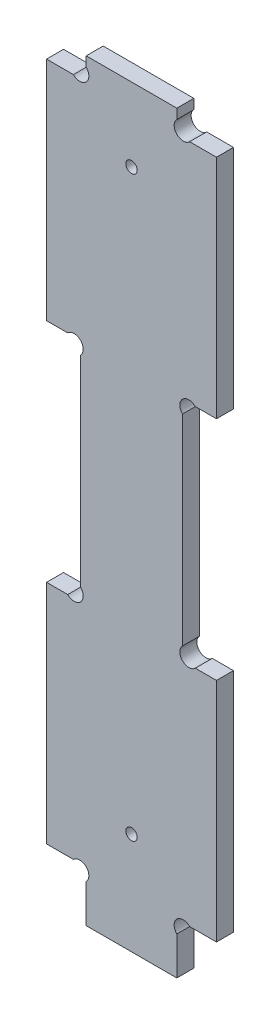
ISO-10303-21;
HEADER;
FILE_DESCRIPTION(('STEP AP214'),'2;1');
FILE_NAME('part.step','',(''),(''),'','','');
FILE_SCHEMA(('AUTOMOTIVE_DESIGN { 1 0 10303 214 1 1 1 1 }'));
ENDSEC;
DATA;
#1=APPLICATION_CONTEXT('core data for automotive mechanical design processes');
#2=APPLICATION_PROTOCOL_DEFINITION('international standard','automotive_design',2000,#1);
#3=PRODUCT_CONTEXT('',#1,'mechanical');
#4=PRODUCT('Part','Part','',(#3));
#5=PRODUCT_RELATED_PRODUCT_CATEGORY('part','',(#4));
#6=PRODUCT_DEFINITION_FORMATION('','',#4);
#7=PRODUCT_DEFINITION_CONTEXT('part definition',#1,'design');
#8=PRODUCT_DEFINITION('design','',#6,#7);
#9=PRODUCT_DEFINITION_SHAPE('','',#8);
#10=(LENGTH_UNIT() NAMED_UNIT(*) SI_UNIT(.MILLI.,.METRE.));
#11=(NAMED_UNIT(*) PLANE_ANGLE_UNIT() SI_UNIT($,.RADIAN.));
#12=(NAMED_UNIT(*) SI_UNIT($,.STERADIAN.) SOLID_ANGLE_UNIT());
#13=UNCERTAINTY_MEASURE_WITH_UNIT(LENGTH_MEASURE(1.E-05),#10,'distance_accuracy_value','');
#14=(GEOMETRIC_REPRESENTATION_CONTEXT(3) GLOBAL_UNCERTAINTY_ASSIGNED_CONTEXT((#13)) GLOBAL_UNIT_ASSIGNED_CONTEXT((#10,
#11,#12)) REPRESENTATION_CONTEXT('',''));
#15=CARTESIAN_POINT('',(0.,0.,0.));
#16=DIRECTION('',(0.,0.,1.));
#17=DIRECTION('',(1.,0.,0.));
#18=AXIS2_PLACEMENT_3D('',#15,#16,#17);
#19=CARTESIAN_POINT('',(30.,49.,3.));
#20=DIRECTION('',(-1.,0.,0.));
#21=DIRECTION('',(0.,-1.,0.));
#22=AXIS2_PLACEMENT_3D('',#19,#20,#21);
#23=PLANE('',#22);
#24=DIRECTION('',(0.,1.,0.));
#25=VECTOR('',#24,1.);
#26=CARTESIAN_POINT('',(30.,49.,0.));
#27=LINE('',#26,#25);
#28=CARTESIAN_POINT('',(30.,9.,0.));
#29=VERTEX_POINT('',#28);
#30=CARTESIAN_POINT('',(30.,49.,0.));
#31=VERTEX_POINT('',#30);
#32=EDGE_CURVE('E250',#29,#31,#27,.T.);
#33=ORIENTED_EDGE('',*,*,#32,.T.);
#34=DIRECTION('',(0.,0.,-1.));
#35=VECTOR('',#34,1.);
#36=CARTESIAN_POINT('',(30.,49.,3.));
#37=LINE('',#36,#35);
#38=CARTESIAN_POINT('',(30.,49.,3.));
#39=VERTEX_POINT('',#38);
#40=EDGE_CURVE('E11',#39,#31,#37,.T.);
#41=ORIENTED_EDGE('',*,*,#40,.F.);
#42=DIRECTION('',(0.,1.,0.));
#43=VECTOR('',#42,1.);
#44=CARTESIAN_POINT('',(30.,49.,3.));
#45=LINE('',#44,#43);
#46=CARTESIAN_POINT('',(30.,9.,3.));
#47=VERTEX_POINT('',#46);
#48=EDGE_CURVE('E305',#47,#39,#45,.T.);
#49=ORIENTED_EDGE('',*,*,#48,.F.);
#50=DIRECTION('',(0.,0.,-1.));
#51=VECTOR('',#50,1.);
#52=CARTESIAN_POINT('',(30.,9.,3.));
#53=LINE('',#52,#51);
#54=EDGE_CURVE('E246',#47,#29,#53,.T.);
#55=ORIENTED_EDGE('',*,*,#54,.T.);
#56=EDGE_LOOP('',(#33,#41,#49,#55));
#57=FACE_BOUND('',#56,.T.);
#58=ADVANCED_FACE('F34',(#57),#23,.F.);
#59=CARTESIAN_POINT('',(26.262741699797,49.,3.));
#60=DIRECTION('',(0.,-1.,0.));
#61=DIRECTION('',(0.,0.,-1.));
#62=AXIS2_PLACEMENT_3D('',#59,#60,#61);
#63=PLANE('',#62);
#64=DIRECTION('',(-1.,0.,0.));
#65=VECTOR('',#64,1.);
#66=CARTESIAN_POINT('',(26.262741699797,49.,0.));
#67=LINE('',#66,#65);
#68=CARTESIAN_POINT('',(26.262741699797,49.,0.));
#69=VERTEX_POINT('',#68);
#70=EDGE_CURVE('E253',#31,#69,#67,.T.);
#71=ORIENTED_EDGE('',*,*,#70,.T.);
#72=DIRECTION('',(0.,0.,-1.));
#73=VECTOR('',#72,1.);
#74=CARTESIAN_POINT('',(26.262741699797,49.,3.));
#75=LINE('',#74,#73);
#76=CARTESIAN_POINT('',(26.262741699797,49.,3.));
#77=VERTEX_POINT('',#76);
#78=EDGE_CURVE('E42',#77,#69,#75,.T.);
#79=ORIENTED_EDGE('',*,*,#78,.F.);
#80=DIRECTION('',(-1.,0.,0.));
#81=VECTOR('',#80,1.);
#82=CARTESIAN_POINT('',(26.262741699797,49.,3.));
#83=LINE('',#82,#81);
#84=EDGE_CURVE('E153',#39,#77,#83,.T.);
#85=ORIENTED_EDGE('',*,*,#84,.F.);
#86=ORIENTED_EDGE('',*,*,#40,.T.);
#87=EDGE_LOOP('',(#71,#79,#85,#86));
#88=FACE_BOUND('',#87,.T.);
#89=ADVANCED_FACE('F464',(#88),#63,.F.);
#90=CARTESIAN_POINT('',(25.1313708498985,50.1313708498985,3.));
#91=DIRECTION('',(0.,0.,-1.));
#92=DIRECTION('',(-1.,0.,0.));
#93=AXIS2_PLACEMENT_3D('',#90,#91,#92);
#94=CYLINDRICAL_SURFACE('',#93,1.60000000000001);
#95=CARTESIAN_POINT('',(25.1313708498985,50.1313708498985,0.));
#96=DIRECTION('',(0.,0.,-1.));
#97=DIRECTION('',(1.,0.,0.));
#98=AXIS2_PLACEMENT_3D('',#95,#96,#97);
#99=CIRCLE('',#98,1.60000000000001);
#100=CARTESIAN_POINT('',(24.,51.262741699797,0.));
#101=VERTEX_POINT('',#100);
#102=EDGE_CURVE('E256',#69,#101,#99,.T.);
#103=ORIENTED_EDGE('',*,*,#102,.T.);
#104=DIRECTION('',(0.,0.,-1.));
#105=VECTOR('',#104,1.);
#106=CARTESIAN_POINT('',(24.,51.262741699797,3.));
#107=LINE('',#106,#105);
#108=CARTESIAN_POINT('',(24.,51.262741699797,3.));
#109=VERTEX_POINT('',#108);
#110=EDGE_CURVE('E372',#109,#101,#107,.T.);
#111=ORIENTED_EDGE('',*,*,#110,.F.);
#112=CARTESIAN_POINT('',(25.1313708498985,50.1313708498985,3.));
#113=DIRECTION('',(0.,0.,-1.));
#114=DIRECTION('',(1.,0.,0.));
#115=AXIS2_PLACEMENT_3D('',#112,#113,#114);
#116=CIRCLE('',#115,1.60000000000001);
#117=EDGE_CURVE('E380',#77,#109,#116,.T.);
#118=ORIENTED_EDGE('',*,*,#117,.F.);
#119=ORIENTED_EDGE('',*,*,#78,.T.);
#120=EDGE_LOOP('',(#103,#111,#118,#119));
#121=FACE_BOUND('',#120,.T.);
#122=ADVANCED_FACE('F378',(#121),#94,.F.);
#123=CARTESIAN_POINT('',(24.,86.737258300203,3.));
#124=DIRECTION('',(-1.,0.,0.));
#125=DIRECTION('',(0.,-1.,0.));
#126=AXIS2_PLACEMENT_3D('',#123,#124,#125);
#127=PLANE('',#126);
#128=DIRECTION('',(0.,1.,0.));
#129=VECTOR('',#128,1.);
#130=CARTESIAN_POINT('',(24.,86.737258300203,0.));
#131=LINE('',#130,#129);
#132=CARTESIAN_POINT('',(24.,86.737258300203,0.));
#133=VERTEX_POINT('',#132);
#134=EDGE_CURVE('E258',#101,#133,#131,.T.);
#135=ORIENTED_EDGE('',*,*,#134,.T.);
#136=DIRECTION('',(0.,0.,-1.));
#137=VECTOR('',#136,1.);
#138=CARTESIAN_POINT('',(24.,86.737258300203,3.));
#139=LINE('',#138,#137);
#140=CARTESIAN_POINT('',(24.,86.737258300203,3.));
#141=VERTEX_POINT('',#140);
#142=EDGE_CURVE('E369',#141,#133,#139,.T.);
#143=ORIENTED_EDGE('',*,*,#142,.F.);
#144=DIRECTION('',(0.,1.,0.));
#145=VECTOR('',#144,1.);
#146=CARTESIAN_POINT('',(24.,86.737258300203,3.));
#147=LINE('',#146,#145);
#148=EDGE_CURVE('E398',#109,#141,#147,.T.);
#149=ORIENTED_EDGE('',*,*,#148,.F.);
#150=ORIENTED_EDGE('',*,*,#110,.T.);
#151=EDGE_LOOP('',(#135,#143,#149,#150));
#152=FACE_BOUND('',#151,.T.);
#153=ADVANCED_FACE('F389',(#152),#127,.F.);
#154=CARTESIAN_POINT('',(25.1313708498985,87.8686291501015,3.));
#155=DIRECTION('',(0.,0.,-1.));
#156=DIRECTION('',(-1.,0.,0.));
#157=AXIS2_PLACEMENT_3D('',#154,#155,#156);
#158=CYLINDRICAL_SURFACE('',#157,1.6);
#159=CARTESIAN_POINT('',(25.1313708498985,87.8686291501015,0.));
#160=DIRECTION('',(0.,0.,-1.));
#161=DIRECTION('',(-1.,0.,0.));
#162=AXIS2_PLACEMENT_3D('',#159,#160,#161);
#163=CIRCLE('',#162,1.6);
#164=CARTESIAN_POINT('',(26.2627416997969,89.,0.));
#165=VERTEX_POINT('',#164);
#166=EDGE_CURVE('E260',#133,#165,#163,.T.);
#167=ORIENTED_EDGE('',*,*,#166,.T.);
#168=DIRECTION('',(0.,0.,-1.));
#169=VECTOR('',#168,1.);
#170=CARTESIAN_POINT('',(26.2627416997969,89.,3.));
#171=LINE('',#170,#169);
#172=CARTESIAN_POINT('',(26.2627416997969,89.,3.));
#173=VERTEX_POINT('',#172);
#174=EDGE_CURVE('E366',#173,#165,#171,.T.);
#175=ORIENTED_EDGE('',*,*,#174,.F.);
#176=CARTESIAN_POINT('',(25.1313708498985,87.8686291501015,3.));
#177=DIRECTION('',(0.,0.,-1.));
#178=DIRECTION('',(-1.,0.,0.));
#179=AXIS2_PLACEMENT_3D('',#176,#177,#178);
#180=CIRCLE('',#179,1.6);
#181=EDGE_CURVE('E395',#141,#173,#180,.T.);
#182=ORIENTED_EDGE('',*,*,#181,.F.);
#183=ORIENTED_EDGE('',*,*,#142,.T.);
#184=EDGE_LOOP('',(#167,#175,#182,#183));
#185=FACE_BOUND('',#184,.T.);
#186=ADVANCED_FACE('F393',(#185),#158,.F.);
#187=CARTESIAN_POINT('',(26.2627416997969,89.,3.));
#188=DIRECTION('',(0.,1.,0.));
#189=DIRECTION('',(0.,0.,1.));
#190=AXIS2_PLACEMENT_3D('',#187,#188,#189);
#191=PLANE('',#190);
#192=DIRECTION('',(1.,0.,0.));
#193=VECTOR('',#192,1.);
#194=CARTESIAN_POINT('',(26.2627416997969,89.,0.));
#195=LINE('',#194,#193);
#196=CARTESIAN_POINT('',(30.,89.,0.));
#197=VERTEX_POINT('',#196);
#198=EDGE_CURVE('E262',#165,#197,#195,.T.);
#199=ORIENTED_EDGE('',*,*,#198,.T.);
#200=DIRECTION('',(0.,0.,-1.));
#201=VECTOR('',#200,1.);
#202=CARTESIAN_POINT('',(30.,89.,3.));
#203=LINE('',#202,#201);
#204=CARTESIAN_POINT('',(30.,89.,3.));
#205=VERTEX_POINT('',#204);
#206=EDGE_CURVE('E363',#205,#197,#203,.T.);
#207=ORIENTED_EDGE('',*,*,#206,.F.);
#208=DIRECTION('',(1.,0.,0.));
#209=VECTOR('',#208,1.);
#210=CARTESIAN_POINT('',(26.2627416997969,89.,3.));
#211=LINE('',#210,#209);
#212=EDGE_CURVE('E397',#173,#205,#211,.T.);
#213=ORIENTED_EDGE('',*,*,#212,.F.);
#214=ORIENTED_EDGE('',*,*,#174,.T.);
#215=EDGE_LOOP('',(#199,#207,#213,#214));
#216=FACE_BOUND('',#215,.T.);
#217=ADVANCED_FACE('F477',(#216),#191,.F.);
#218=CARTESIAN_POINT('',(30.,89.,3.));
#219=DIRECTION('',(-1.,0.,0.));
#220=DIRECTION('',(0.,0.,1.));
#221=AXIS2_PLACEMENT_3D('',#218,#219,#220);
#222=PLANE('',#221);
#223=DIRECTION('',(0.,1.,0.));
#224=VECTOR('',#223,1.);
#225=CARTESIAN_POINT('',(30.,89.,0.));
#226=LINE('',#225,#224);
#227=CARTESIAN_POINT('',(30.,129.,0.));
#228=VERTEX_POINT('',#227);
#229=EDGE_CURVE('E264',#197,#228,#226,.T.);
#230=ORIENTED_EDGE('',*,*,#229,.T.);
#231=DIRECTION('',(0.,0.,-1.));
#232=VECTOR('',#231,1.);
#233=CARTESIAN_POINT('',(30.,129.,3.));
#234=LINE('',#233,#232);
#235=CARTESIAN_POINT('',(30.,129.,3.));
#236=VERTEX_POINT('',#235);
#237=EDGE_CURVE('E360',#236,#228,#234,.T.);
#238=ORIENTED_EDGE('',*,*,#237,.F.);
#239=DIRECTION('',(0.,1.,0.));
#240=VECTOR('',#239,1.);
#241=CARTESIAN_POINT('',(30.,89.,3.));
#242=LINE('',#241,#240);
#243=EDGE_CURVE('E400',#205,#236,#242,.T.);
#244=ORIENTED_EDGE('',*,*,#243,.F.);
#245=ORIENTED_EDGE('',*,*,#206,.T.);
#246=EDGE_LOOP('',(#230,#238,#244,#245));
#247=FACE_BOUND('',#246,.T.);
#248=ADVANCED_FACE('F480',(#247),#222,.F.);
#249=CARTESIAN_POINT('',(25.262741699797,129.,3.));
#250=DIRECTION('',(0.,-1.,0.));
#251=DIRECTION('',(0.,0.,-1.));
#252=AXIS2_PLACEMENT_3D('',#249,#250,#251);
#253=PLANE('',#252);
#254=DIRECTION('',(-1.,0.,0.));
#255=VECTOR('',#254,1.);
#256=CARTESIAN_POINT('',(25.262741699797,129.,0.));
#257=LINE('',#256,#255);
#258=CARTESIAN_POINT('',(25.262741699797,129.,0.));
#259=VERTEX_POINT('',#258);
#260=EDGE_CURVE('E266',#228,#259,#257,.T.);
#261=ORIENTED_EDGE('',*,*,#260,.T.);
#262=DIRECTION('',(0.,0.,-1.));
#263=VECTOR('',#262,1.);
#264=CARTESIAN_POINT('',(25.262741699797,129.,3.));
#265=LINE('',#264,#263);
#266=CARTESIAN_POINT('',(25.262741699797,129.,3.));
#267=VERTEX_POINT('',#266);
#268=EDGE_CURVE('E357',#267,#259,#265,.T.);
#269=ORIENTED_EDGE('',*,*,#268,.F.);
#270=DIRECTION('',(-1.,0.,0.));
#271=VECTOR('',#270,1.);
#272=CARTESIAN_POINT('',(25.262741699797,129.,3.));
#273=LINE('',#272,#271);
#274=EDGE_CURVE('E406',#236,#267,#273,.T.);
#275=ORIENTED_EDGE('',*,*,#274,.F.);
#276=ORIENTED_EDGE('',*,*,#237,.T.);
#277=EDGE_LOOP('',(#261,#269,#275,#276));
#278=FACE_BOUND('',#277,.T.);
#279=ADVANCED_FACE('F484',(#278),#253,.F.);
#280=CARTESIAN_POINT('',(24.1313708498985,130.131370849898,3.));
#281=DIRECTION('',(0.,0.,-1.));
#282=DIRECTION('',(-1.,0.,0.));
#283=AXIS2_PLACEMENT_3D('',#280,#281,#282);
#284=CYLINDRICAL_SURFACE('',#283,1.60000000000001);
#285=CARTESIAN_POINT('',(24.1313708498985,130.131370849898,0.));
#286=DIRECTION('',(0.,0.,-1.));
#287=DIRECTION('',(-1.,0.,0.));
#288=AXIS2_PLACEMENT_3D('',#285,#286,#287);
#289=CIRCLE('',#288,1.60000000000001);
#290=CARTESIAN_POINT('',(23.,131.262741699797,0.));
#291=VERTEX_POINT('',#290);
#292=EDGE_CURVE('E268',#259,#291,#289,.T.);
#293=ORIENTED_EDGE('',*,*,#292,.T.);
#294=DIRECTION('',(0.,0.,-1.));
#295=VECTOR('',#294,1.);
#296=CARTESIAN_POINT('',(23.,131.262741699797,3.));
#297=LINE('',#296,#295);
#298=CARTESIAN_POINT('',(23.,131.262741699797,3.));
#299=VERTEX_POINT('',#298);
#300=EDGE_CURVE('E354',#299,#291,#297,.T.);
#301=ORIENTED_EDGE('',*,*,#300,.F.);
#302=CARTESIAN_POINT('',(24.1313708498985,130.131370849898,3.));
#303=DIRECTION('',(0.,0.,-1.));
#304=DIRECTION('',(-1.,0.,0.));
#305=AXIS2_PLACEMENT_3D('',#302,#303,#304);
#306=CIRCLE('',#305,1.60000000000001);
#307=EDGE_CURVE('E408',#267,#299,#306,.T.);
#308=ORIENTED_EDGE('',*,*,#307,.F.);
#309=ORIENTED_EDGE('',*,*,#268,.T.);
#310=EDGE_LOOP('',(#293,#301,#308,#309));
#311=FACE_BOUND('',#310,.T.);
#312=ADVANCED_FACE('F488',(#311),#284,.F.);
#313=CARTESIAN_POINT('',(23.,131.262741699797,3.));
#314=DIRECTION('',(-1.,0.,0.));
#315=DIRECTION('',(0.,0.,1.));
#316=AXIS2_PLACEMENT_3D('',#313,#314,#315);
#317=PLANE('',#316);
#318=DIRECTION('',(0.,1.,0.));
#319=VECTOR('',#318,1.);
#320=CARTESIAN_POINT('',(23.,131.262741699797,0.));
#321=LINE('',#320,#319);
#322=CARTESIAN_POINT('',(23.,133.,0.));
#323=VERTEX_POINT('',#322);
#324=EDGE_CURVE('E270',#291,#323,#321,.T.);
#325=ORIENTED_EDGE('',*,*,#324,.T.);
#326=DIRECTION('',(0.,0.,-1.));
#327=VECTOR('',#326,1.);
#328=CARTESIAN_POINT('',(23.,133.,3.));
#329=LINE('',#328,#327);
#330=CARTESIAN_POINT('',(23.,133.,3.));
#331=VERTEX_POINT('',#330);
#332=EDGE_CURVE('E351',#331,#323,#329,.T.);
#333=ORIENTED_EDGE('',*,*,#332,.F.);
#334=DIRECTION('',(0.,1.,0.));
#335=VECTOR('',#334,1.);
#336=CARTESIAN_POINT('',(23.,131.262741699797,3.));
#337=LINE('',#336,#335);
#338=EDGE_CURVE('E410',#299,#331,#337,.T.);
#339=ORIENTED_EDGE('',*,*,#338,.F.);
#340=ORIENTED_EDGE('',*,*,#300,.T.);
#341=EDGE_LOOP('',(#325,#333,#339,#340));
#342=FACE_BOUND('',#341,.T.);
#343=ADVANCED_FACE('F492',(#342),#317,.F.);
#344=CARTESIAN_POINT('',(6.99999999999998,133.,3.));
#345=DIRECTION('',(0.,-1.,0.));
#346=DIRECTION('',(0.,0.,-1.));
#347=AXIS2_PLACEMENT_3D('',#344,#345,#346);
#348=PLANE('',#347);
#349=DIRECTION('',(-1.,0.,0.));
#350=VECTOR('',#349,1.);
#351=CARTESIAN_POINT('',(6.99999999999998,133.,0.));
#352=LINE('',#351,#350);
#353=CARTESIAN_POINT('',(6.99999999999998,133.,0.));
#354=VERTEX_POINT('',#353);
#355=EDGE_CURVE('E272',#323,#354,#352,.T.);
#356=ORIENTED_EDGE('',*,*,#355,.T.);
#357=DIRECTION('',(0.,0.,-1.));
#358=VECTOR('',#357,1.);
#359=CARTESIAN_POINT('',(6.99999999999998,133.,3.));
#360=LINE('',#359,#358);
#361=CARTESIAN_POINT('',(6.99999999999998,133.,3.));
#362=VERTEX_POINT('',#361);
#363=EDGE_CURVE('E348',#362,#354,#360,.T.);
#364=ORIENTED_EDGE('',*,*,#363,.F.);
#365=DIRECTION('',(-1.,0.,0.));
#366=VECTOR('',#365,1.);
#367=CARTESIAN_POINT('',(6.99999999999998,133.,3.));
#368=LINE('',#367,#366);
#369=EDGE_CURVE('E412',#331,#362,#368,.T.);
#370=ORIENTED_EDGE('',*,*,#369,.F.);
#371=ORIENTED_EDGE('',*,*,#332,.T.);
#372=EDGE_LOOP('',(#356,#364,#370,#371));
#373=FACE_BOUND('',#372,.T.);
#374=ADVANCED_FACE('F496',(#373),#348,.F.);
#375=CARTESIAN_POINT('',(6.99999999999998,131.262741699797,3.));
#376=DIRECTION('',(1.,0.,0.));
#377=DIRECTION('',(0.,0.,-1.));
#378=AXIS2_PLACEMENT_3D('',#375,#376,#377);
#379=PLANE('',#378);
#380=DIRECTION('',(0.,-1.,0.));
#381=VECTOR('',#380,1.);
#382=CARTESIAN_POINT('',(6.99999999999998,131.262741699797,0.));
#383=LINE('',#382,#381);
#384=CARTESIAN_POINT('',(6.99999999999998,131.262741699797,0.));
#385=VERTEX_POINT('',#384);
#386=EDGE_CURVE('E274',#354,#385,#383,.T.);
#387=ORIENTED_EDGE('',*,*,#386,.T.);
#388=DIRECTION('',(0.,0.,-1.));
#389=VECTOR('',#388,1.);
#390=CARTESIAN_POINT('',(6.99999999999998,131.262741699797,3.));
#391=LINE('',#390,#389);
#392=CARTESIAN_POINT('',(6.99999999999998,131.262741699797,3.));
#393=VERTEX_POINT('',#392);
#394=EDGE_CURVE('E345',#393,#385,#391,.T.);
#395=ORIENTED_EDGE('',*,*,#394,.F.);
#396=DIRECTION('',(0.,-1.,0.));
#397=VECTOR('',#396,1.);
#398=CARTESIAN_POINT('',(6.99999999999998,131.262741699797,3.));
#399=LINE('',#398,#397);
#400=EDGE_CURVE('E414',#362,#393,#399,.T.);
#401=ORIENTED_EDGE('',*,*,#400,.F.);
#402=ORIENTED_EDGE('',*,*,#363,.T.);
#403=EDGE_LOOP('',(#387,#395,#401,#402));
#404=FACE_BOUND('',#403,.T.);
#405=ADVANCED_FACE('F500',(#404),#379,.F.);
#406=CARTESIAN_POINT('',(5.8686291501015,130.131370849898,3.));
#407=DIRECTION('',(0.,0.,-1.));
#408=DIRECTION('',(-1.,0.,0.));
#409=AXIS2_PLACEMENT_3D('',#406,#407,#408);
#410=CYLINDRICAL_SURFACE('',#409,1.6);
#411=CARTESIAN_POINT('',(5.8686291501015,130.131370849898,0.));
#412=DIRECTION('',(0.,0.,-1.));
#413=DIRECTION('',(1.,0.,0.));
#414=AXIS2_PLACEMENT_3D('',#411,#412,#413);
#415=CIRCLE('',#414,1.6);
#416=CARTESIAN_POINT('',(4.73725830020302,129.,0.));
#417=VERTEX_POINT('',#416);
#418=EDGE_CURVE('E276',#385,#417,#415,.T.);
#419=ORIENTED_EDGE('',*,*,#418,.T.);
#420=DIRECTION('',(0.,0.,-1.));
#421=VECTOR('',#420,1.);
#422=CARTESIAN_POINT('',(4.73725830020302,129.,3.));
#423=LINE('',#422,#421);
#424=CARTESIAN_POINT('',(4.73725830020302,129.,3.));
#425=VERTEX_POINT('',#424);
#426=EDGE_CURVE('E342',#425,#417,#423,.T.);
#427=ORIENTED_EDGE('',*,*,#426,.F.);
#428=CARTESIAN_POINT('',(5.8686291501015,130.131370849898,3.));
#429=DIRECTION('',(0.,0.,-1.));
#430=DIRECTION('',(1.,0.,0.));
#431=AXIS2_PLACEMENT_3D('',#428,#429,#430);
#432=CIRCLE('',#431,1.6);
#433=EDGE_CURVE('E416',#393,#425,#432,.T.);
#434=ORIENTED_EDGE('',*,*,#433,.F.);
#435=ORIENTED_EDGE('',*,*,#394,.T.);
#436=EDGE_LOOP('',(#419,#427,#434,#435));
#437=FACE_BOUND('',#436,.T.);
#438=ADVANCED_FACE('F504',(#437),#410,.F.);
#439=CARTESIAN_POINT('',(4.73725830020302,129.,3.));
#440=DIRECTION('',(0.,-1.,0.));
#441=DIRECTION('',(0.,0.,-1.));
#442=AXIS2_PLACEMENT_3D('',#439,#440,#441);
#443=PLANE('',#442);
#444=DIRECTION('',(-1.,0.,0.));
#445=VECTOR('',#444,1.);
#446=CARTESIAN_POINT('',(4.73725830020302,129.,0.));
#447=LINE('',#446,#445);
#448=CARTESIAN_POINT('',(0.,129.,0.));
#449=VERTEX_POINT('',#448);
#450=EDGE_CURVE('E278',#417,#449,#447,.T.);
#451=ORIENTED_EDGE('',*,*,#450,.T.);
#452=DIRECTION('',(0.,0.,-1.));
#453=VECTOR('',#452,1.);
#454=CARTESIAN_POINT('',(0.,129.,3.));
#455=LINE('',#454,#453);
#456=CARTESIAN_POINT('',(0.,129.,3.));
#457=VERTEX_POINT('',#456);
#458=EDGE_CURVE('E339',#457,#449,#455,.T.);
#459=ORIENTED_EDGE('',*,*,#458,.F.);
#460=DIRECTION('',(-1.,0.,0.));
#461=VECTOR('',#460,1.);
#462=CARTESIAN_POINT('',(4.73725830020302,129.,3.));
#463=LINE('',#462,#461);
#464=EDGE_CURVE('E418',#425,#457,#463,.T.);
#465=ORIENTED_EDGE('',*,*,#464,.F.);
#466=ORIENTED_EDGE('',*,*,#426,.T.);
#467=EDGE_LOOP('',(#451,#459,#465,#466));
#468=FACE_BOUND('',#467,.T.);
#469=ADVANCED_FACE('F508',(#468),#443,.F.);
#470=CARTESIAN_POINT('',(0.,89.,3.));
#471=DIRECTION('',(1.,0.,0.));
#472=DIRECTION('',(0.,1.,0.));
#473=AXIS2_PLACEMENT_3D('',#470,#471,#472);
#474=PLANE('',#473);
#475=DIRECTION('',(0.,-1.,0.));
#476=VECTOR('',#475,1.);
#477=CARTESIAN_POINT('',(0.,89.,0.));
#478=LINE('',#477,#476);
#479=CARTESIAN_POINT('',(0.,89.,0.));
#480=VERTEX_POINT('',#479);
#481=EDGE_CURVE('E280',#449,#480,#478,.T.);
#482=ORIENTED_EDGE('',*,*,#481,.T.);
#483=DIRECTION('',(0.,0.,-1.));
#484=VECTOR('',#483,1.);
#485=CARTESIAN_POINT('',(0.,89.,3.));
#486=LINE('',#485,#484);
#487=CARTESIAN_POINT('',(0.,89.,3.));
#488=VERTEX_POINT('',#487);
#489=EDGE_CURVE('E336',#488,#480,#486,.T.);
#490=ORIENTED_EDGE('',*,*,#489,.F.);
#491=DIRECTION('',(0.,-1.,0.));
#492=VECTOR('',#491,1.);
#493=CARTESIAN_POINT('',(0.,89.,3.));
#494=LINE('',#493,#492);
#495=EDGE_CURVE('E420',#457,#488,#494,.T.);
#496=ORIENTED_EDGE('',*,*,#495,.F.);
#497=ORIENTED_EDGE('',*,*,#458,.T.);
#498=EDGE_LOOP('',(#482,#490,#496,#497));
#499=FACE_BOUND('',#498,.T.);
#500=ADVANCED_FACE('F512',(#499),#474,.F.);
#501=CARTESIAN_POINT('',(3.73725830020304,89.,3.));
#502=DIRECTION('',(0.,1.,0.));
#503=DIRECTION('',(0.,0.,1.));
#504=AXIS2_PLACEMENT_3D('',#501,#502,#503);
#505=PLANE('',#504);
#506=DIRECTION('',(1.,0.,0.));
#507=VECTOR('',#506,1.);
#508=CARTESIAN_POINT('',(3.73725830020304,89.,0.));
#509=LINE('',#508,#507);
#510=CARTESIAN_POINT('',(3.73725830020304,89.,0.));
#511=VERTEX_POINT('',#510);
#512=EDGE_CURVE('E282',#480,#511,#509,.T.);
#513=ORIENTED_EDGE('',*,*,#512,.T.);
#514=DIRECTION('',(0.,0.,-1.));
#515=VECTOR('',#514,1.);
#516=CARTESIAN_POINT('',(3.73725830020304,89.,3.));
#517=LINE('',#516,#515);
#518=CARTESIAN_POINT('',(3.73725830020304,89.,3.));
#519=VERTEX_POINT('',#518);
#520=EDGE_CURVE('E333',#519,#511,#517,.T.);
#521=ORIENTED_EDGE('',*,*,#520,.F.);
#522=DIRECTION('',(1.,0.,0.));
#523=VECTOR('',#522,1.);
#524=CARTESIAN_POINT('',(3.73725830020304,89.,3.));
#525=LINE('',#524,#523);
#526=EDGE_CURVE('E422',#488,#519,#525,.T.);
#527=ORIENTED_EDGE('',*,*,#526,.F.);
#528=ORIENTED_EDGE('',*,*,#489,.T.);
#529=EDGE_LOOP('',(#513,#521,#527,#528));
#530=FACE_BOUND('',#529,.T.);
#531=ADVANCED_FACE('F516',(#530),#505,.F.);
#532=CARTESIAN_POINT('',(4.86862915010152,87.8686291501015,3.));
#533=DIRECTION('',(0.,0.,-1.));
#534=DIRECTION('',(-1.,0.,0.));
#535=AXIS2_PLACEMENT_3D('',#532,#533,#534);
#536=CYLINDRICAL_SURFACE('',#535,1.6);
#537=CARTESIAN_POINT('',(4.86862915010152,87.8686291501015,0.));
#538=DIRECTION('',(0.,0.,-1.));
#539=DIRECTION('',(1.,0.,0.));
#540=AXIS2_PLACEMENT_3D('',#537,#538,#539);
#541=CIRCLE('',#540,1.6);
#542=CARTESIAN_POINT('',(5.99999999999999,86.737258300203,0.));
#543=VERTEX_POINT('',#542);
#544=EDGE_CURVE('E284',#511,#543,#541,.T.);
#545=ORIENTED_EDGE('',*,*,#544,.T.);
#546=DIRECTION('',(0.,0.,-1.));
#547=VECTOR('',#546,1.);
#548=CARTESIAN_POINT('',(5.99999999999999,86.737258300203,3.));
#549=LINE('',#548,#547);
#550=CARTESIAN_POINT('',(5.99999999999999,86.737258300203,3.));
#551=VERTEX_POINT('',#550);
#552=EDGE_CURVE('E330',#551,#543,#549,.T.);
#553=ORIENTED_EDGE('',*,*,#552,.F.);
#554=CARTESIAN_POINT('',(4.86862915010152,87.8686291501015,3.));
#555=DIRECTION('',(0.,0.,-1.));
#556=DIRECTION('',(1.,0.,0.));
#557=AXIS2_PLACEMENT_3D('',#554,#555,#556);
#558=CIRCLE('',#557,1.6);
#559=EDGE_CURVE('E424',#519,#551,#558,.T.);
#560=ORIENTED_EDGE('',*,*,#559,.F.);
#561=ORIENTED_EDGE('',*,*,#520,.T.);
#562=EDGE_LOOP('',(#545,#553,#560,#561));
#563=FACE_BOUND('',#562,.T.);
#564=ADVANCED_FACE('F520',(#563),#536,.F.);
#565=CARTESIAN_POINT('',(5.99999999999999,86.737258300203,3.));
#566=DIRECTION('',(1.,0.,0.));
#567=DIRECTION('',(0.,1.,0.));
#568=AXIS2_PLACEMENT_3D('',#565,#566,#567);
#569=PLANE('',#568);
#570=DIRECTION('',(0.,-1.,0.));
#571=VECTOR('',#570,1.);
#572=CARTESIAN_POINT('',(5.99999999999999,86.737258300203,0.));
#573=LINE('',#572,#571);
#574=CARTESIAN_POINT('',(6.,51.262741699797,0.));
#575=VERTEX_POINT('',#574);
#576=EDGE_CURVE('E286',#543,#575,#573,.T.);
#577=ORIENTED_EDGE('',*,*,#576,.T.);
#578=DIRECTION('',(0.,0.,-1.));
#579=VECTOR('',#578,1.);
#580=CARTESIAN_POINT('',(6.,51.262741699797,3.));
#581=LINE('',#580,#579);
#582=CARTESIAN_POINT('',(6.,51.262741699797,3.));
#583=VERTEX_POINT('',#582);
#584=EDGE_CURVE('E327',#583,#575,#581,.T.);
#585=ORIENTED_EDGE('',*,*,#584,.F.);
#586=DIRECTION('',(0.,-1.,0.));
#587=VECTOR('',#586,1.);
#588=CARTESIAN_POINT('',(5.99999999999999,86.737258300203,3.));
#589=LINE('',#588,#587);
#590=EDGE_CURVE('E426',#551,#583,#589,.T.);
#591=ORIENTED_EDGE('',*,*,#590,.F.);
#592=ORIENTED_EDGE('',*,*,#552,.T.);
#593=EDGE_LOOP('',(#577,#585,#591,#592));
#594=FACE_BOUND('',#593,.T.);
#595=ADVANCED_FACE('F524',(#594),#569,.F.);
#596=CARTESIAN_POINT('',(4.86862915010152,50.1313708498985,3.));
#597=DIRECTION('',(0.,0.,-1.));
#598=DIRECTION('',(-1.,0.,0.));
#599=AXIS2_PLACEMENT_3D('',#596,#597,#598);
#600=CYLINDRICAL_SURFACE('',#599,1.6);
#601=CARTESIAN_POINT('',(4.86862915010152,50.1313708498985,0.));
#602=DIRECTION('',(0.,0.,-1.));
#603=DIRECTION('',(-1.,0.,0.));
#604=AXIS2_PLACEMENT_3D('',#601,#602,#603);
#605=CIRCLE('',#604,1.6);
#606=CARTESIAN_POINT('',(3.73725830020305,49.,0.));
#607=VERTEX_POINT('',#606);
#608=EDGE_CURVE('E288',#575,#607,#605,.T.);
#609=ORIENTED_EDGE('',*,*,#608,.T.);
#610=DIRECTION('',(0.,0.,-1.));
#611=VECTOR('',#610,1.);
#612=CARTESIAN_POINT('',(3.73725830020305,49.,3.));
#613=LINE('',#612,#611);
#614=CARTESIAN_POINT('',(3.73725830020305,49.,3.));
#615=VERTEX_POINT('',#614);
#616=EDGE_CURVE('E324',#615,#607,#613,.T.);
#617=ORIENTED_EDGE('',*,*,#616,.F.);
#618=CARTESIAN_POINT('',(4.86862915010152,50.1313708498985,3.));
#619=DIRECTION('',(0.,0.,-1.));
#620=DIRECTION('',(-1.,0.,0.));
#621=AXIS2_PLACEMENT_3D('',#618,#619,#620);
#622=CIRCLE('',#621,1.6);
#623=EDGE_CURVE('E428',#583,#615,#622,.T.);
#624=ORIENTED_EDGE('',*,*,#623,.F.);
#625=ORIENTED_EDGE('',*,*,#584,.T.);
#626=EDGE_LOOP('',(#609,#617,#624,#625));
#627=FACE_BOUND('',#626,.T.);
#628=ADVANCED_FACE('F528',(#627),#600,.F.);
#629=CARTESIAN_POINT('',(3.73725830020305,49.,3.));
#630=DIRECTION('',(0.,-1.,0.));
#631=DIRECTION('',(0.,0.,-1.));
#632=AXIS2_PLACEMENT_3D('',#629,#630,#631);
#633=PLANE('',#632);
#634=DIRECTION('',(-1.,0.,0.));
#635=VECTOR('',#634,1.);
#636=CARTESIAN_POINT('',(3.73725830020305,49.,0.));
#637=LINE('',#636,#635);
#638=CARTESIAN_POINT('',(0.,49.,0.));
#639=VERTEX_POINT('',#638);
#640=EDGE_CURVE('E290',#607,#639,#637,.T.);
#641=ORIENTED_EDGE('',*,*,#640,.T.);
#642=DIRECTION('',(0.,0.,-1.));
#643=VECTOR('',#642,1.);
#644=CARTESIAN_POINT('',(0.,49.,3.));
#645=LINE('',#644,#643);
#646=CARTESIAN_POINT('',(0.,49.,3.));
#647=VERTEX_POINT('',#646);
#648=EDGE_CURVE('E321',#647,#639,#645,.T.);
#649=ORIENTED_EDGE('',*,*,#648,.F.);
#650=DIRECTION('',(-1.,0.,0.));
#651=VECTOR('',#650,1.);
#652=CARTESIAN_POINT('',(3.73725830020305,49.,3.));
#653=LINE('',#652,#651);
#654=EDGE_CURVE('E430',#615,#647,#653,.T.);
#655=ORIENTED_EDGE('',*,*,#654,.F.);
#656=ORIENTED_EDGE('',*,*,#616,.T.);
#657=EDGE_LOOP('',(#641,#649,#655,#656));
#658=FACE_BOUND('',#657,.T.);
#659=ADVANCED_FACE('F532',(#658),#633,.F.);
#660=CARTESIAN_POINT('',(0.,49.,3.));
#661=DIRECTION('',(1.,0.,0.));
#662=DIRECTION('',(0.,1.,0.));
#663=AXIS2_PLACEMENT_3D('',#660,#661,#662);
#664=PLANE('',#663);
#665=DIRECTION('',(0.,-1.,0.));
#666=VECTOR('',#665,1.);
#667=CARTESIAN_POINT('',(0.,49.,0.));
#668=LINE('',#667,#666);
#669=CARTESIAN_POINT('',(0.,9.,0.));
#670=VERTEX_POINT('',#669);
#671=EDGE_CURVE('E292',#639,#670,#668,.T.);
#672=ORIENTED_EDGE('',*,*,#671,.T.);
#673=DIRECTION('',(0.,0.,-1.));
#674=VECTOR('',#673,1.);
#675=CARTESIAN_POINT('',(0.,9.,3.));
#676=LINE('',#675,#674);
#677=CARTESIAN_POINT('',(0.,9.,3.));
#678=VERTEX_POINT('',#677);
#679=EDGE_CURVE('E318',#678,#670,#676,.T.);
#680=ORIENTED_EDGE('',*,*,#679,.F.);
#681=DIRECTION('',(0.,-1.,0.));
#682=VECTOR('',#681,1.);
#683=CARTESIAN_POINT('',(0.,49.,3.));
#684=LINE('',#683,#682);
#685=EDGE_CURVE('E432',#647,#678,#684,.T.);
#686=ORIENTED_EDGE('',*,*,#685,.F.);
#687=ORIENTED_EDGE('',*,*,#648,.T.);
#688=EDGE_LOOP('',(#672,#680,#686,#687));
#689=FACE_BOUND('',#688,.T.);
#690=ADVANCED_FACE('F536',(#689),#664,.F.);
#691=CARTESIAN_POINT('',(4.73725830020302,9.,3.));
#692=DIRECTION('',(0.,1.,0.));
#693=DIRECTION('',(0.,0.,1.));
#694=AXIS2_PLACEMENT_3D('',#691,#692,#693);
#695=PLANE('',#694);
#696=DIRECTION('',(1.,0.,0.));
#697=VECTOR('',#696,1.);
#698=CARTESIAN_POINT('',(4.73725830020302,9.,0.));
#699=LINE('',#698,#697);
#700=CARTESIAN_POINT('',(4.73725830020302,9.,0.));
#701=VERTEX_POINT('',#700);
#702=EDGE_CURVE('E294',#670,#701,#699,.T.);
#703=ORIENTED_EDGE('',*,*,#702,.T.);
#704=DIRECTION('',(0.,0.,-1.));
#705=VECTOR('',#704,1.);
#706=CARTESIAN_POINT('',(4.73725830020302,9.,3.));
#707=LINE('',#706,#705);
#708=CARTESIAN_POINT('',(4.73725830020302,9.,3.));
#709=VERTEX_POINT('',#708);
#710=EDGE_CURVE('E315',#709,#701,#707,.T.);
#711=ORIENTED_EDGE('',*,*,#710,.F.);
#712=DIRECTION('',(1.,0.,0.));
#713=VECTOR('',#712,1.);
#714=CARTESIAN_POINT('',(4.73725830020302,9.,3.));
#715=LINE('',#714,#713);
#716=EDGE_CURVE('E434',#678,#709,#715,.T.);
#717=ORIENTED_EDGE('',*,*,#716,.F.);
#718=ORIENTED_EDGE('',*,*,#679,.T.);
#719=EDGE_LOOP('',(#703,#711,#717,#718));
#720=FACE_BOUND('',#719,.T.);
#721=ADVANCED_FACE('F540',(#720),#695,.F.);
#722=CARTESIAN_POINT('',(5.8686291501015,7.86862915010153,3.));
#723=DIRECTION('',(0.,0.,-1.));
#724=DIRECTION('',(-1.,0.,0.));
#725=AXIS2_PLACEMENT_3D('',#722,#723,#724);
#726=CYLINDRICAL_SURFACE('',#725,1.6);
#727=CARTESIAN_POINT('',(5.8686291501015,7.86862915010153,0.));
#728=DIRECTION('',(0.,0.,-1.));
#729=DIRECTION('',(-1.,0.,0.));
#730=AXIS2_PLACEMENT_3D('',#727,#728,#729);
#731=CIRCLE('',#730,1.6);
#732=CARTESIAN_POINT('',(6.99999999999999,6.73725830020305,0.));
#733=VERTEX_POINT('',#732);
#734=EDGE_CURVE('E296',#701,#733,#731,.T.);
#735=ORIENTED_EDGE('',*,*,#734,.T.);
#736=DIRECTION('',(0.,0.,-1.));
#737=VECTOR('',#736,1.);
#738=CARTESIAN_POINT('',(6.99999999999999,6.73725830020305,3.));
#739=LINE('',#738,#737);
#740=CARTESIAN_POINT('',(6.99999999999999,6.73725830020305,3.));
#741=VERTEX_POINT('',#740);
#742=EDGE_CURVE('E312',#741,#733,#739,.T.);
#743=ORIENTED_EDGE('',*,*,#742,.F.);
#744=CARTESIAN_POINT('',(5.8686291501015,7.86862915010153,3.));
#745=DIRECTION('',(0.,0.,-1.));
#746=DIRECTION('',(-1.,0.,0.));
#747=AXIS2_PLACEMENT_3D('',#744,#745,#746);
#748=CIRCLE('',#747,1.6);
#749=EDGE_CURVE('E436',#709,#741,#748,.T.);
#750=ORIENTED_EDGE('',*,*,#749,.F.);
#751=ORIENTED_EDGE('',*,*,#710,.T.);
#752=EDGE_LOOP('',(#735,#743,#750,#751));
#753=FACE_BOUND('',#752,.T.);
#754=ADVANCED_FACE('F544',(#753),#726,.F.);
#755=CARTESIAN_POINT('',(6.99999999999999,6.73725830020305,3.));
#756=DIRECTION('',(1.,0.,0.));
#757=DIRECTION('',(0.,1.,0.));
#758=AXIS2_PLACEMENT_3D('',#755,#756,#757);
#759=PLANE('',#758);
#760=DIRECTION('',(0.,-1.,0.));
#761=VECTOR('',#760,1.);
#762=CARTESIAN_POINT('',(6.99999999999999,6.73725830020305,0.));
#763=LINE('',#762,#761);
#764=CARTESIAN_POINT('',(6.99999999999998,0.,0.));
#765=VERTEX_POINT('',#764);
#766=EDGE_CURVE('E298',#733,#765,#763,.T.);
#767=ORIENTED_EDGE('',*,*,#766,.T.);
#768=DIRECTION('',(0.,0.,-1.));
#769=VECTOR('',#768,1.);
#770=CARTESIAN_POINT('',(6.99999999999998,0.,3.));
#771=LINE('',#770,#769);
#772=CARTESIAN_POINT('',(6.99999999999998,0.,3.));
#773=VERTEX_POINT('',#772);
#774=EDGE_CURVE('E309',#773,#765,#771,.T.);
#775=ORIENTED_EDGE('',*,*,#774,.F.);
#776=DIRECTION('',(0.,-1.,0.));
#777=VECTOR('',#776,1.);
#778=CARTESIAN_POINT('',(6.99999999999999,6.73725830020305,3.));
#779=LINE('',#778,#777);
#780=EDGE_CURVE('E438',#741,#773,#779,.T.);
#781=ORIENTED_EDGE('',*,*,#780,.F.);
#782=ORIENTED_EDGE('',*,*,#742,.T.);
#783=EDGE_LOOP('',(#767,#775,#781,#782));
#784=FACE_BOUND('',#783,.T.);
#785=ADVANCED_FACE('F444',(#784),#759,.F.);
#786=CARTESIAN_POINT('',(6.99999999999998,0.,3.));
#787=DIRECTION('',(0.,1.,0.));
#788=DIRECTION('',(0.,0.,1.));
#789=AXIS2_PLACEMENT_3D('',#786,#787,#788);
#790=PLANE('',#789);
#791=DIRECTION('',(1.,0.,0.));
#792=VECTOR('',#791,1.);
#793=CARTESIAN_POINT('',(6.99999999999998,0.,0.));
#794=LINE('',#793,#792);
#795=CARTESIAN_POINT('',(23.,0.,0.));
#796=VERTEX_POINT('',#795);
#797=EDGE_CURVE('E300',#765,#796,#794,.T.);
#798=ORIENTED_EDGE('',*,*,#797,.T.);
#799=DIRECTION('',(0.,0.,-1.));
#800=VECTOR('',#799,1.);
#801=CARTESIAN_POINT('',(23.,0.,3.));
#802=LINE('',#801,#800);
#803=CARTESIAN_POINT('',(23.,0.,3.));
#804=VERTEX_POINT('',#803);
#805=EDGE_CURVE('E241',#804,#796,#802,.T.);
#806=ORIENTED_EDGE('',*,*,#805,.F.);
#807=DIRECTION('',(1.,0.,0.));
#808=VECTOR('',#807,1.);
#809=CARTESIAN_POINT('',(6.99999999999998,0.,3.));
#810=LINE('',#809,#808);
#811=EDGE_CURVE('E232',#773,#804,#810,.T.);
#812=ORIENTED_EDGE('',*,*,#811,.F.);
#813=ORIENTED_EDGE('',*,*,#774,.T.);
#814=EDGE_LOOP('',(#798,#806,#812,#813));
#815=FACE_BOUND('',#814,.T.);
#816=ADVANCED_FACE('F448',(#815),#790,.F.);
#817=CARTESIAN_POINT('',(23.,6.73725830020305,3.));
#818=DIRECTION('',(-1.,0.,0.));
#819=DIRECTION('',(0.,-1.,0.));
#820=AXIS2_PLACEMENT_3D('',#817,#818,#819);
#821=PLANE('',#820);
#822=DIRECTION('',(0.,1.,0.));
#823=VECTOR('',#822,1.);
#824=CARTESIAN_POINT('',(23.,6.73725830020305,0.));
#825=LINE('',#824,#823);
#826=CARTESIAN_POINT('',(23.,6.73725830020305,0.));
#827=VERTEX_POINT('',#826);
#828=EDGE_CURVE('E240',#796,#827,#825,.T.);
#829=ORIENTED_EDGE('',*,*,#828,.T.);
#830=DIRECTION('',(0.,0.,-1.));
#831=VECTOR('',#830,1.);
#832=CARTESIAN_POINT('',(23.,6.73725830020305,3.));
#833=LINE('',#832,#831);
#834=CARTESIAN_POINT('',(23.,6.73725830020305,3.));
#835=VERTEX_POINT('',#834);
#836=EDGE_CURVE('E237',#835,#827,#833,.T.);
#837=ORIENTED_EDGE('',*,*,#836,.F.);
#838=DIRECTION('',(0.,1.,0.));
#839=VECTOR('',#838,1.);
#840=CARTESIAN_POINT('',(23.,6.73725830020305,3.));
#841=LINE('',#840,#839);
#842=EDGE_CURVE('E226',#804,#835,#841,.T.);
#843=ORIENTED_EDGE('',*,*,#842,.F.);
#844=ORIENTED_EDGE('',*,*,#805,.T.);
#845=EDGE_LOOP('',(#829,#837,#843,#844));
#846=FACE_BOUND('',#845,.T.);
#847=ADVANCED_FACE('F238',(#846),#821,.F.);
#848=CARTESIAN_POINT('',(24.1313708498985,7.86862915010153,3.));
#849=DIRECTION('',(0.,0.,-1.));
#850=DIRECTION('',(-1.,0.,0.));
#851=AXIS2_PLACEMENT_3D('',#848,#849,#850);
#852=CYLINDRICAL_SURFACE('',#851,1.6);
#853=CARTESIAN_POINT('',(24.1313708498985,7.86862915010153,0.));
#854=DIRECTION('',(0.,0.,-1.));
#855=DIRECTION('',(1.,0.,0.));
#856=AXIS2_PLACEMENT_3D('',#853,#854,#855);
#857=CIRCLE('',#856,1.6);
#858=CARTESIAN_POINT('',(25.262741699797,9.,0.));
#859=VERTEX_POINT('',#858);
#860=EDGE_CURVE('E139',#827,#859,#857,.T.);
#861=ORIENTED_EDGE('',*,*,#860,.T.);
#862=DIRECTION('',(0.,0.,-1.));
#863=VECTOR('',#862,1.);
#864=CARTESIAN_POINT('',(25.262741699797,9.,3.));
#865=LINE('',#864,#863);
#866=CARTESIAN_POINT('',(25.262741699797,9.,3.));
#867=VERTEX_POINT('',#866);
#868=EDGE_CURVE('E242',#867,#859,#865,.T.);
#869=ORIENTED_EDGE('',*,*,#868,.F.);
#870=CARTESIAN_POINT('',(24.1313708498985,7.86862915010153,3.));
#871=DIRECTION('',(0.,0.,-1.));
#872=DIRECTION('',(1.,0.,0.));
#873=AXIS2_PLACEMENT_3D('',#870,#871,#872);
#874=CIRCLE('',#873,1.6);
#875=EDGE_CURVE('E230',#835,#867,#874,.T.);
#876=ORIENTED_EDGE('',*,*,#875,.F.);
#877=ORIENTED_EDGE('',*,*,#836,.T.);
#878=EDGE_LOOP('',(#861,#869,#876,#877));
#879=FACE_BOUND('',#878,.T.);
#880=ADVANCED_FACE('F244',(#879),#852,.F.);
#881=CARTESIAN_POINT('',(25.262741699797,9.,3.));
#882=DIRECTION('',(0.,1.,0.));
#883=DIRECTION('',(-1.,0.,0.));
#884=AXIS2_PLACEMENT_3D('',#881,#882,#883);
#885=PLANE('',#884);
#886=DIRECTION('',(1.,0.,0.));
#887=VECTOR('',#886,1.);
#888=CARTESIAN_POINT('',(25.262741699797,9.,0.));
#889=LINE('',#888,#887);
#890=EDGE_CURVE('E145',#859,#29,#889,.T.);
#891=ORIENTED_EDGE('',*,*,#890,.T.);
#892=ORIENTED_EDGE('',*,*,#54,.F.);
#893=DIRECTION('',(1.,0.,0.));
#894=VECTOR('',#893,1.);
#895=CARTESIAN_POINT('',(25.262741699797,9.,3.));
#896=LINE('',#895,#894);
#897=EDGE_CURVE('E50',#867,#47,#896,.T.);
#898=ORIENTED_EDGE('',*,*,#897,.F.);
#899=ORIENTED_EDGE('',*,*,#868,.T.);
#900=EDGE_LOOP('',(#891,#892,#898,#899));
#901=FACE_BOUND('',#900,.T.);
#902=ADVANCED_FACE('F452',(#901),#885,.F.);
#903=CARTESIAN_POINT('',(24.1313708498985,7.86862915010153,3.));
#904=DIRECTION('',(0.,0.,1.));
#905=DIRECTION('',(1.,0.,0.));
#906=AXIS2_PLACEMENT_3D('',#903,#904,#905);
#907=PLANE('',#906);
#908=CARTESIAN_POINT('',(15.,18.,3.));
#909=DIRECTION('',(0.,0.,1.));
#910=DIRECTION('',(1.,0.,0.));
#911=AXIS2_PLACEMENT_3D('',#908,#909,#910);
#912=CIRCLE('',#911,1.);
#913=CARTESIAN_POINT('',(16.,18.,3.));
#914=VERTEX_POINT('',#913);
#915=EDGE_CURVE('E609',#914,#914,#912,.T.);
#916=ORIENTED_EDGE('',*,*,#915,.F.);
#917=EDGE_LOOP('',(#916));
#918=FACE_BOUND('',#917,.T.);
#919=CARTESIAN_POINT('',(15.,120.,3.));
#920=DIRECTION('',(0.,0.,1.));
#921=DIRECTION('',(1.,0.,0.));
#922=AXIS2_PLACEMENT_3D('',#919,#920,#921);
#923=CIRCLE('',#922,1.);
#924=CARTESIAN_POINT('',(16.,120.,3.));
#925=VERTEX_POINT('',#924);
#926=EDGE_CURVE('E614',#925,#925,#923,.T.);
#927=ORIENTED_EDGE('',*,*,#926,.F.);
#928=EDGE_LOOP('',(#927));
#929=FACE_BOUND('',#928,.T.);
#930=ORIENTED_EDGE('',*,*,#48,.T.);
#931=ORIENTED_EDGE('',*,*,#84,.T.);
#932=ORIENTED_EDGE('',*,*,#117,.T.);
#933=ORIENTED_EDGE('',*,*,#148,.T.);
#934=ORIENTED_EDGE('',*,*,#181,.T.);
#935=ORIENTED_EDGE('',*,*,#212,.T.);
#936=ORIENTED_EDGE('',*,*,#243,.T.);
#937=ORIENTED_EDGE('',*,*,#274,.T.);
#938=ORIENTED_EDGE('',*,*,#307,.T.);
#939=ORIENTED_EDGE('',*,*,#338,.T.);
#940=ORIENTED_EDGE('',*,*,#369,.T.);
#941=ORIENTED_EDGE('',*,*,#400,.T.);
#942=ORIENTED_EDGE('',*,*,#433,.T.);
#943=ORIENTED_EDGE('',*,*,#464,.T.);
#944=ORIENTED_EDGE('',*,*,#495,.T.);
#945=ORIENTED_EDGE('',*,*,#526,.T.);
#946=ORIENTED_EDGE('',*,*,#559,.T.);
#947=ORIENTED_EDGE('',*,*,#590,.T.);
#948=ORIENTED_EDGE('',*,*,#623,.T.);
#949=ORIENTED_EDGE('',*,*,#654,.T.);
#950=ORIENTED_EDGE('',*,*,#685,.T.);
#951=ORIENTED_EDGE('',*,*,#716,.T.);
#952=ORIENTED_EDGE('',*,*,#749,.T.);
#953=ORIENTED_EDGE('',*,*,#780,.T.);
#954=ORIENTED_EDGE('',*,*,#811,.T.);
#955=ORIENTED_EDGE('',*,*,#842,.T.);
#956=ORIENTED_EDGE('',*,*,#875,.T.);
#957=ORIENTED_EDGE('',*,*,#897,.T.);
#958=EDGE_LOOP('',(#930,#931,#932,#933,#934,#935,#936,#937,#938,#939,#940,#941,#942,#943,#944,
#945,#946,#947,#948,#949,#950,#951,#952,#953,#954,#955,#956,#957));
#959=FACE_BOUND('',#958,.T.);
#960=ADVANCED_FACE('F228',(#918,#929,#959),#907,.T.);
#961=CARTESIAN_POINT('',(24.1313708498985,7.86862915010153,0.));
#962=DIRECTION('',(0.,0.,1.));
#963=DIRECTION('',(1.,0.,0.));
#964=AXIS2_PLACEMENT_3D('',#961,#962,#963);
#965=PLANE('',#964);
#966=CARTESIAN_POINT('',(15.,18.,0.));
#967=DIRECTION('',(0.,0.,1.));
#968=DIRECTION('',(1.,0.,0.));
#969=AXIS2_PLACEMENT_3D('',#966,#967,#968);
#970=CIRCLE('',#969,1.);
#971=CARTESIAN_POINT('',(16.,18.,0.));
#972=VERTEX_POINT('',#971);
#973=EDGE_CURVE('E254',#972,#972,#970,.T.);
#974=ORIENTED_EDGE('',*,*,#973,.T.);
#975=EDGE_LOOP('',(#974));
#976=FACE_BOUND('',#975,.T.);
#977=CARTESIAN_POINT('',(15.,120.,0.));
#978=DIRECTION('',(0.,0.,1.));
#979=DIRECTION('',(1.,0.,0.));
#980=AXIS2_PLACEMENT_3D('',#977,#978,#979);
#981=CIRCLE('',#980,1.);
#982=CARTESIAN_POINT('',(16.,120.,0.));
#983=VERTEX_POINT('',#982);
#984=EDGE_CURVE('E610',#983,#983,#981,.T.);
#985=ORIENTED_EDGE('',*,*,#984,.T.);
#986=EDGE_LOOP('',(#985));
#987=FACE_BOUND('',#986,.T.);
#988=ORIENTED_EDGE('',*,*,#32,.F.);
#989=ORIENTED_EDGE('',*,*,#890,.F.);
#990=ORIENTED_EDGE('',*,*,#860,.F.);
#991=ORIENTED_EDGE('',*,*,#828,.F.);
#992=ORIENTED_EDGE('',*,*,#797,.F.);
#993=ORIENTED_EDGE('',*,*,#766,.F.);
#994=ORIENTED_EDGE('',*,*,#734,.F.);
#995=ORIENTED_EDGE('',*,*,#702,.F.);
#996=ORIENTED_EDGE('',*,*,#671,.F.);
#997=ORIENTED_EDGE('',*,*,#640,.F.);
#998=ORIENTED_EDGE('',*,*,#608,.F.);
#999=ORIENTED_EDGE('',*,*,#576,.F.);
#1000=ORIENTED_EDGE('',*,*,#544,.F.);
#1001=ORIENTED_EDGE('',*,*,#512,.F.);
#1002=ORIENTED_EDGE('',*,*,#481,.F.);
#1003=ORIENTED_EDGE('',*,*,#450,.F.);
#1004=ORIENTED_EDGE('',*,*,#418,.F.);
#1005=ORIENTED_EDGE('',*,*,#386,.F.);
#1006=ORIENTED_EDGE('',*,*,#355,.F.);
#1007=ORIENTED_EDGE('',*,*,#324,.F.);
#1008=ORIENTED_EDGE('',*,*,#292,.F.);
#1009=ORIENTED_EDGE('',*,*,#260,.F.);
#1010=ORIENTED_EDGE('',*,*,#229,.F.);
#1011=ORIENTED_EDGE('',*,*,#198,.F.);
#1012=ORIENTED_EDGE('',*,*,#166,.F.);
#1013=ORIENTED_EDGE('',*,*,#134,.F.);
#1014=ORIENTED_EDGE('',*,*,#102,.F.);
#1015=ORIENTED_EDGE('',*,*,#70,.F.);
#1016=EDGE_LOOP('',(#988,#989,#990,#991,#992,#993,#994,#995,#996,#997,#998,#999,#1000,#1001,
#1002,#1003,#1004,#1005,#1006,#1007,#1008,#1009,#1010,#1011,#1012,#1013,#1014,#1015));
#1017=FACE_BOUND('',#1016,.T.);
#1018=ADVANCED_FACE('F384',(#976,#987,#1017),#965,.F.);
#1019=CARTESIAN_POINT('',(15.,120.,0.));
#1020=DIRECTION('',(0.,0.,1.));
#1021=DIRECTION('',(1.,0.,0.));
#1022=AXIS2_PLACEMENT_3D('',#1019,#1020,#1021);
#1023=CYLINDRICAL_SURFACE('',#1022,1.);
#1024=ORIENTED_EDGE('',*,*,#984,.F.);
#1025=EDGE_LOOP('',(#1024));
#1026=FACE_BOUND('',#1025,.T.);
#1027=ORIENTED_EDGE('',*,*,#926,.T.);
#1028=EDGE_LOOP('',(#1027));
#1029=FACE_BOUND('',#1028,.T.);
#1030=ADVANCED_FACE('F581',(#1026,#1029),#1023,.F.);
#1031=CARTESIAN_POINT('',(15.,18.,0.));
#1032=DIRECTION('',(0.,0.,1.));
#1033=DIRECTION('',(1.,0.,0.));
#1034=AXIS2_PLACEMENT_3D('',#1031,#1032,#1033);
#1035=CYLINDRICAL_SURFACE('',#1034,1.);
#1036=ORIENTED_EDGE('',*,*,#973,.F.);
#1037=EDGE_LOOP('',(#1036));
#1038=FACE_BOUND('',#1037,.T.);
#1039=ORIENTED_EDGE('',*,*,#915,.T.);
#1040=EDGE_LOOP('',(#1039));
#1041=FACE_BOUND('',#1040,.T.);
#1042=ADVANCED_FACE('F590',(#1038,#1041),#1035,.F.);
#1043=CLOSED_SHELL('',(#58,#89,#122,#153,#186,#217,#248,#279,#312,#343,#374,#405,#438,#469,#500,
#531,#564,#595,#628,#659,#690,#721,#754,#785,#816,#847,#880,#902,#960,#1018,#1030,#1042));
#1044=MANIFOLD_SOLID_BREP('B2',#1043);
#1045=ADVANCED_BREP_SHAPE_REPRESENTATION('',(#18,#1044),#14);
#1046=SHAPE_DEFINITION_REPRESENTATION(#9,#1045);
ENDSEC;
END-ISO-10303-21;
